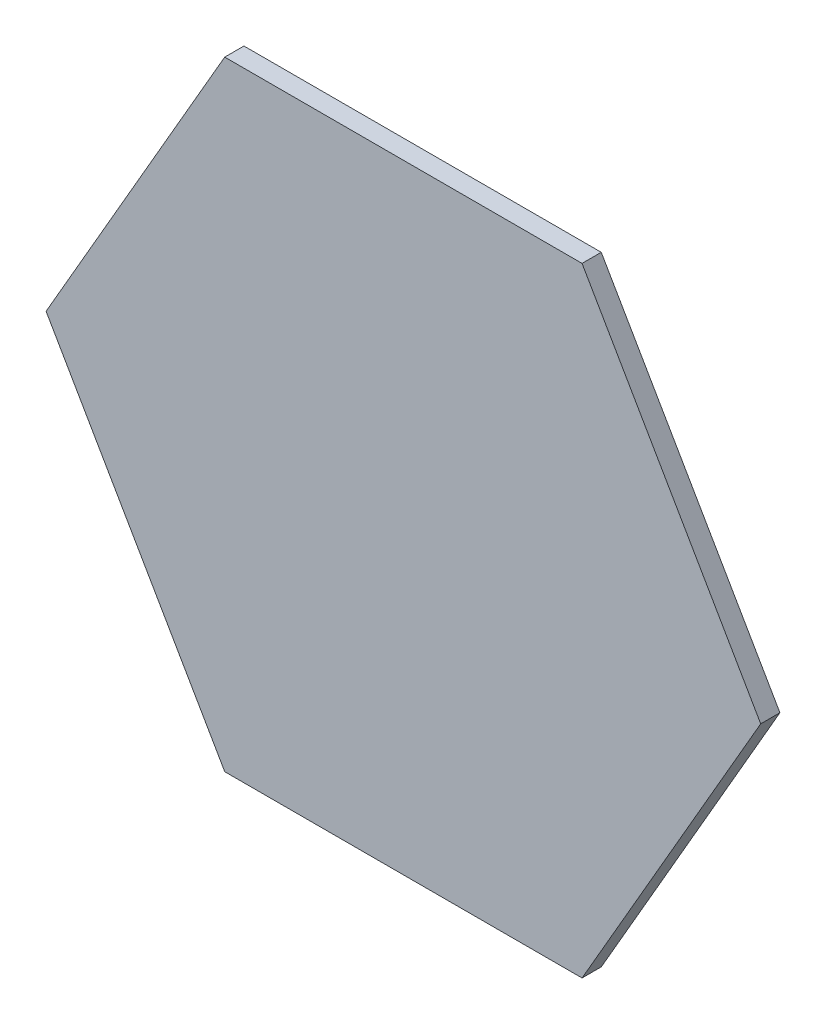
ISO-10303-21;
HEADER;
FILE_DESCRIPTION(('STEP AP214'),'2;1');
FILE_NAME('part.step','',(''),(''),'','','');
FILE_SCHEMA(('AUTOMOTIVE_DESIGN { 1 0 10303 214 1 1 1 1 }'));
ENDSEC;
DATA;
#1=APPLICATION_CONTEXT('core data for automotive mechanical design processes');
#2=APPLICATION_PROTOCOL_DEFINITION('international standard','automotive_design',2000,#1);
#3=PRODUCT_CONTEXT('',#1,'mechanical');
#4=PRODUCT('Part','Part','',(#3));
#5=PRODUCT_RELATED_PRODUCT_CATEGORY('part','',(#4));
#6=PRODUCT_DEFINITION_FORMATION('','',#4);
#7=PRODUCT_DEFINITION_CONTEXT('part definition',#1,'design');
#8=PRODUCT_DEFINITION('design','',#6,#7);
#9=PRODUCT_DEFINITION_SHAPE('','',#8);
#10=(LENGTH_UNIT() NAMED_UNIT(*) SI_UNIT(.MILLI.,.METRE.));
#11=(NAMED_UNIT(*) PLANE_ANGLE_UNIT() SI_UNIT($,.RADIAN.));
#12=(NAMED_UNIT(*) SI_UNIT($,.STERADIAN.) SOLID_ANGLE_UNIT());
#13=UNCERTAINTY_MEASURE_WITH_UNIT(LENGTH_MEASURE(1.E-05),#10,'distance_accuracy_value','');
#14=(GEOMETRIC_REPRESENTATION_CONTEXT(3) GLOBAL_UNCERTAINTY_ASSIGNED_CONTEXT((#13)) GLOBAL_UNIT_ASSIGNED_CONTEXT((#10,
#11,#12)) REPRESENTATION_CONTEXT('',''));
#15=CARTESIAN_POINT('',(0.,0.,0.));
#16=DIRECTION('',(0.,0.,1.));
#17=DIRECTION('',(1.,0.,0.));
#18=AXIS2_PLACEMENT_3D('',#15,#16,#17);
#19=CARTESIAN_POINT('',(-1860.,-5.6843418860808E-13,0.));
#20=DIRECTION('',(-0.866025403784439,-0.5,0.));
#21=DIRECTION('',(0.5,-0.866025403784439,0.));
#22=AXIS2_PLACEMENT_3D('',#19,#20,#21);
#23=PLANE('',#22);
#24=DIRECTION('',(0.5,-0.866025403784439,0.));
#25=VECTOR('',#24,1.);
#26=CARTESIAN_POINT('',(-1395.,-805.403625519529,100.));
#27=LINE('',#26,#25);
#28=CARTESIAN_POINT('',(-1860.,1.13686837721616E-12,100.));
#29=VERTEX_POINT('',#28);
#30=CARTESIAN_POINT('',(-929.999999999999,-1610.80725103906,100.));
#31=VERTEX_POINT('',#30);
#32=EDGE_CURVE('E9',#29,#31,#27,.T.);
#33=ORIENTED_EDGE('',*,*,#32,.F.);
#34=DIRECTION('',(0.,0.,1.));
#35=VECTOR('',#34,1.);
#36=CARTESIAN_POINT('',(-1860.,-5.6843418860808E-13,50.));
#37=LINE('',#36,#35);
#38=CARTESIAN_POINT('',(-1860.,1.13686837721616E-12,0.));
#39=VERTEX_POINT('',#38);
#40=EDGE_CURVE('E26',#39,#29,#37,.T.);
#41=ORIENTED_EDGE('',*,*,#40,.F.);
#42=DIRECTION('',(0.5,-0.866025403784439,0.));
#43=VECTOR('',#42,1.);
#44=CARTESIAN_POINT('',(-1395.,-805.403625519529,0.));
#45=LINE('',#44,#43);
#46=CARTESIAN_POINT('',(-929.999999999999,-1610.80725103906,0.));
#47=VERTEX_POINT('',#46);
#48=EDGE_CURVE('E87',#39,#47,#45,.T.);
#49=ORIENTED_EDGE('',*,*,#48,.T.);
#50=DIRECTION('',(0.,0.,1.));
#51=VECTOR('',#50,1.);
#52=CARTESIAN_POINT('',(-929.999999999999,-1610.80725103906,50.));
#53=LINE('',#52,#51);
#54=EDGE_CURVE('E35',#47,#31,#53,.T.);
#55=ORIENTED_EDGE('',*,*,#54,.T.);
#56=EDGE_LOOP('',(#33,#41,#49,#55));
#57=FACE_BOUND('',#56,.T.);
#58=ADVANCED_FACE('F15',(#57),#23,.T.);
#59=CARTESIAN_POINT('',(-930.,-1610.80725103906,0.));
#60=DIRECTION('',(0.,-1.,0.));
#61=DIRECTION('',(0.,0.,-1.));
#62=AXIS2_PLACEMENT_3D('',#59,#60,#61);
#63=PLANE('',#62);
#64=DIRECTION('',(1.,0.,0.));
#65=VECTOR('',#64,1.);
#66=CARTESIAN_POINT('',(4.54747350886464E-13,-1610.80725103906,100.));
#67=LINE('',#66,#65);
#68=CARTESIAN_POINT('',(930.,-1610.80725103906,100.));
#69=VERTEX_POINT('',#68);
#70=EDGE_CURVE('E124',#31,#69,#67,.T.);
#71=ORIENTED_EDGE('',*,*,#70,.F.);
#72=ORIENTED_EDGE('',*,*,#54,.F.);
#73=DIRECTION('',(1.,0.,0.));
#74=VECTOR('',#73,1.);
#75=CARTESIAN_POINT('',(4.54747350886464E-13,-1610.80725103906,0.));
#76=LINE('',#75,#74);
#77=CARTESIAN_POINT('',(930.,-1610.80725103906,0.));
#78=VERTEX_POINT('',#77);
#79=EDGE_CURVE('E112',#47,#78,#76,.T.);
#80=ORIENTED_EDGE('',*,*,#79,.T.);
#81=DIRECTION('',(0.,0.,1.));
#82=VECTOR('',#81,1.);
#83=CARTESIAN_POINT('',(930.,-1610.80725103906,50.));
#84=LINE('',#83,#82);
#85=EDGE_CURVE('E109',#78,#69,#84,.T.);
#86=ORIENTED_EDGE('',*,*,#85,.T.);
#87=EDGE_LOOP('',(#71,#72,#80,#86));
#88=FACE_BOUND('',#87,.T.);
#89=ADVANCED_FACE('F135',(#88),#63,.T.);
#90=CARTESIAN_POINT('',(930.000000000001,-1610.80725103906,0.));
#91=DIRECTION('',(0.866025403784439,-0.5,0.));
#92=DIRECTION('',(0.5,0.866025403784439,0.));
#93=AXIS2_PLACEMENT_3D('',#90,#91,#92);
#94=PLANE('',#93);
#95=DIRECTION('',(0.5,0.866025403784439,0.));
#96=VECTOR('',#95,1.);
#97=CARTESIAN_POINT('',(1395.,-805.403625519528,100.));
#98=LINE('',#97,#96);
#99=CARTESIAN_POINT('',(1860.,-1.36424205265939E-12,100.));
#100=VERTEX_POINT('',#99);
#101=EDGE_CURVE('E116',#69,#100,#98,.T.);
#102=ORIENTED_EDGE('',*,*,#101,.F.);
#103=ORIENTED_EDGE('',*,*,#85,.F.);
#104=DIRECTION('',(0.5,0.866025403784439,0.));
#105=VECTOR('',#104,1.);
#106=CARTESIAN_POINT('',(1395.,-805.403625519528,0.));
#107=LINE('',#106,#105);
#108=CARTESIAN_POINT('',(1860.,-1.36424205265939E-12,0.));
#109=VERTEX_POINT('',#108);
#110=EDGE_CURVE('E102',#78,#109,#107,.T.);
#111=ORIENTED_EDGE('',*,*,#110,.T.);
#112=DIRECTION('',(0.,0.,1.));
#113=VECTOR('',#112,1.);
#114=CARTESIAN_POINT('',(1860.,6.82121026329696E-13,50.));
#115=LINE('',#114,#113);
#116=EDGE_CURVE('E99',#109,#100,#115,.T.);
#117=ORIENTED_EDGE('',*,*,#116,.T.);
#118=EDGE_LOOP('',(#102,#103,#111,#117));
#119=FACE_BOUND('',#118,.T.);
#120=ADVANCED_FACE('F141',(#119),#94,.T.);
#121=CARTESIAN_POINT('',(930.,1610.80725103905,0.));
#122=DIRECTION('',(-0.866025403784438,-0.500000000000001,0.));
#123=DIRECTION('',(0.500000000000001,-0.866025403784438,0.));
#124=AXIS2_PLACEMENT_3D('',#121,#122,#123);
#125=PLANE('',#124);
#126=DIRECTION('',(-0.500000000000001,0.866025403784438,0.));
#127=VECTOR('',#126,1.);
#128=CARTESIAN_POINT('',(1395.,805.403625519527,100.));
#129=LINE('',#128,#127);
#130=CARTESIAN_POINT('',(930.,1610.80725103905,100.));
#131=VERTEX_POINT('',#130);
#132=EDGE_CURVE('E106',#100,#131,#129,.T.);
#133=ORIENTED_EDGE('',*,*,#132,.F.);
#134=ORIENTED_EDGE('',*,*,#116,.F.);
#135=DIRECTION('',(-0.500000000000001,0.866025403784438,0.));
#136=VECTOR('',#135,1.);
#137=CARTESIAN_POINT('',(1395.,805.403625519527,0.));
#138=LINE('',#137,#136);
#139=CARTESIAN_POINT('',(930.,1610.80725103905,0.));
#140=VERTEX_POINT('',#139);
#141=EDGE_CURVE('E77',#109,#140,#138,.T.);
#142=ORIENTED_EDGE('',*,*,#141,.T.);
#143=DIRECTION('',(0.,0.,1.));
#144=VECTOR('',#143,1.);
#145=CARTESIAN_POINT('',(930.,1610.80725103905,50.));
#146=LINE('',#145,#144);
#147=EDGE_CURVE('E72',#140,#131,#146,.T.);
#148=ORIENTED_EDGE('',*,*,#147,.T.);
#149=EDGE_LOOP('',(#133,#134,#142,#148));
#150=FACE_BOUND('',#149,.T.);
#151=ADVANCED_FACE('F144',(#150),#125,.F.);
#152=CARTESIAN_POINT('',(-930.000000000001,1610.80725103906,0.));
#153=DIRECTION('',(0.,-1.,0.));
#154=DIRECTION('',(0.,0.,-1.));
#155=AXIS2_PLACEMENT_3D('',#152,#153,#154);
#156=PLANE('',#155);
#157=DIRECTION('',(-1.,0.,0.));
#158=VECTOR('',#157,1.);
#159=CARTESIAN_POINT('',(-1.25055521493778E-12,1610.80725103906,100.));
#160=LINE('',#159,#158);
#161=CARTESIAN_POINT('',(-930.000000000001,1610.80725103906,100.));
#162=VERTEX_POINT('',#161);
#163=EDGE_CURVE('E97',#131,#162,#160,.T.);
#164=ORIENTED_EDGE('',*,*,#163,.F.);
#165=ORIENTED_EDGE('',*,*,#147,.F.);
#166=DIRECTION('',(-1.,0.,0.));
#167=VECTOR('',#166,1.);
#168=CARTESIAN_POINT('',(-1.25055521493778E-12,1610.80725103906,0.));
#169=LINE('',#168,#167);
#170=CARTESIAN_POINT('',(-930.000000000001,1610.80725103906,0.));
#171=VERTEX_POINT('',#170);
#172=EDGE_CURVE('E70',#140,#171,#169,.T.);
#173=ORIENTED_EDGE('',*,*,#172,.T.);
#174=DIRECTION('',(0.,0.,1.));
#175=VECTOR('',#174,1.);
#176=CARTESIAN_POINT('',(-930.000000000001,1610.80725103906,50.));
#177=LINE('',#176,#175);
#178=EDGE_CURVE('E66',#171,#162,#177,.T.);
#179=ORIENTED_EDGE('',*,*,#178,.T.);
#180=EDGE_LOOP('',(#164,#165,#173,#179));
#181=FACE_BOUND('',#180,.T.);
#182=ADVANCED_FACE('F71',(#181),#156,.F.);
#183=CARTESIAN_POINT('',(-1860.,1.13686837721616E-12,0.));
#184=DIRECTION('',(0.866025403784438,-0.500000000000001,0.));
#185=DIRECTION('',(0.500000000000001,0.866025403784438,0.));
#186=AXIS2_PLACEMENT_3D('',#183,#184,#185);
#187=PLANE('',#186);
#188=DIRECTION('',(-0.500000000000001,-0.866025403784438,0.));
#189=VECTOR('',#188,1.);
#190=CARTESIAN_POINT('',(-1395.,805.403625519529,100.));
#191=LINE('',#190,#189);
#192=EDGE_CURVE('E85',#162,#29,#191,.T.);
#193=ORIENTED_EDGE('',*,*,#192,.F.);
#194=ORIENTED_EDGE('',*,*,#178,.F.);
#195=DIRECTION('',(-0.500000000000001,-0.866025403784438,0.));
#196=VECTOR('',#195,1.);
#197=CARTESIAN_POINT('',(-1395.,805.403625519529,0.));
#198=LINE('',#197,#196);
#199=EDGE_CURVE('E19',#171,#39,#198,.T.);
#200=ORIENTED_EDGE('',*,*,#199,.T.);
#201=ORIENTED_EDGE('',*,*,#40,.T.);
#202=EDGE_LOOP('',(#193,#194,#200,#201));
#203=FACE_BOUND('',#202,.T.);
#204=ADVANCED_FACE('F82',(#203),#187,.F.);
#205=CARTESIAN_POINT('',(0.,0.,100.));
#206=DIRECTION('',(0.,0.,1.));
#207=DIRECTION('',(1.,0.,0.));
#208=AXIS2_PLACEMENT_3D('',#205,#206,#207);
#209=PLANE('',#208);
#210=ORIENTED_EDGE('',*,*,#192,.T.);
#211=ORIENTED_EDGE('',*,*,#32,.T.);
#212=ORIENTED_EDGE('',*,*,#70,.T.);
#213=ORIENTED_EDGE('',*,*,#101,.T.);
#214=ORIENTED_EDGE('',*,*,#132,.T.);
#215=ORIENTED_EDGE('',*,*,#163,.T.);
#216=EDGE_LOOP('',(#210,#211,#212,#213,#214,#215));
#217=FACE_BOUND('',#216,.T.);
#218=ADVANCED_FACE('F146',(#217),#209,.T.);
#219=CARTESIAN_POINT('',(0.,0.,0.));
#220=DIRECTION('',(0.,0.,1.));
#221=DIRECTION('',(1.,0.,0.));
#222=AXIS2_PLACEMENT_3D('',#219,#220,#221);
#223=PLANE('',#222);
#224=ORIENTED_EDGE('',*,*,#48,.F.);
#225=ORIENTED_EDGE('',*,*,#199,.F.);
#226=ORIENTED_EDGE('',*,*,#172,.F.);
#227=ORIENTED_EDGE('',*,*,#141,.F.);
#228=ORIENTED_EDGE('',*,*,#110,.F.);
#229=ORIENTED_EDGE('',*,*,#79,.F.);
#230=EDGE_LOOP('',(#224,#225,#226,#227,#228,#229));
#231=FACE_BOUND('',#230,.T.);
#232=ADVANCED_FACE('F17',(#231),#223,.F.);
#233=CLOSED_SHELL('',(#58,#89,#120,#151,#182,#204,#218,#232));
#234=MANIFOLD_SOLID_BREP('B1',#233);
#235=ADVANCED_BREP_SHAPE_REPRESENTATION('',(#18,#234),#14);
#236=SHAPE_DEFINITION_REPRESENTATION(#9,#235);
ENDSEC;
END-ISO-10303-21;
